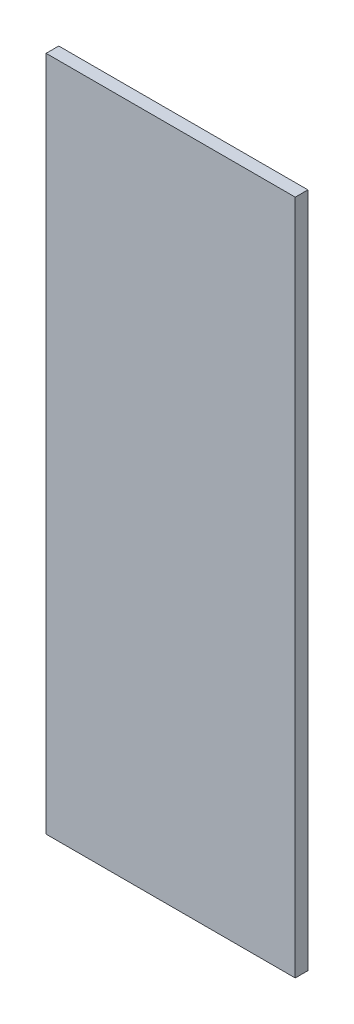
ISO-10303-21;
HEADER;
FILE_DESCRIPTION(('STEP AP214'),'2;1');
FILE_NAME('part.step','',(''),(''),'','','');
FILE_SCHEMA(('AUTOMOTIVE_DESIGN { 1 0 10303 214 1 1 1 1 }'));
ENDSEC;
DATA;
#1=APPLICATION_CONTEXT('core data for automotive mechanical design processes');
#2=APPLICATION_PROTOCOL_DEFINITION('international standard','automotive_design',2000,#1);
#3=PRODUCT_CONTEXT('',#1,'mechanical');
#4=PRODUCT('Part','Part','',(#3));
#5=PRODUCT_RELATED_PRODUCT_CATEGORY('part','',(#4));
#6=PRODUCT_DEFINITION_FORMATION('','',#4);
#7=PRODUCT_DEFINITION_CONTEXT('part definition',#1,'design');
#8=PRODUCT_DEFINITION('design','',#6,#7);
#9=PRODUCT_DEFINITION_SHAPE('','',#8);
#10=(LENGTH_UNIT() NAMED_UNIT(*) SI_UNIT(.MILLI.,.METRE.));
#11=(NAMED_UNIT(*) PLANE_ANGLE_UNIT() SI_UNIT($,.RADIAN.));
#12=(NAMED_UNIT(*) SI_UNIT($,.STERADIAN.) SOLID_ANGLE_UNIT());
#13=UNCERTAINTY_MEASURE_WITH_UNIT(LENGTH_MEASURE(1.E-05),#10,'distance_accuracy_value','');
#14=(GEOMETRIC_REPRESENTATION_CONTEXT(3) GLOBAL_UNCERTAINTY_ASSIGNED_CONTEXT((#13)) GLOBAL_UNIT_ASSIGNED_CONTEXT((#10,
#11,#12)) REPRESENTATION_CONTEXT('',''));
#15=CARTESIAN_POINT('',(0.,0.,0.));
#16=DIRECTION('',(0.,0.,1.));
#17=DIRECTION('',(1.,0.,0.));
#18=AXIS2_PLACEMENT_3D('',#15,#16,#17);
#19=CARTESIAN_POINT('',(89.1920013427734,76.5279998779297,0.));
#20=DIRECTION('',(1.,0.,0.));
#21=DIRECTION('',(0.,-1.,0.));
#22=AXIS2_PLACEMENT_3D('',#19,#20,#21);
#23=PLANE('',#22);
#24=DIRECTION('',(0.,-1.,0.));
#25=VECTOR('',#24,1.);
#26=CARTESIAN_POINT('',(89.1920013427734,76.5279998779297,0.03556));
#27=LINE('',#26,#25);
#28=CARTESIAN_POINT('',(89.1920013427734,76.5279998779297,0.03556));
#29=VERTEX_POINT('',#28);
#30=CARTESIAN_POINT('',(89.1920013427734,74.6279983520508,0.03556));
#31=VERTEX_POINT('',#30);
#32=EDGE_CURVE('E11',#29,#31,#27,.T.);
#33=ORIENTED_EDGE('',*,*,#32,.F.);
#34=DIRECTION('',(0.,0.,1.));
#35=VECTOR('',#34,1.);
#36=CARTESIAN_POINT('',(89.1920013427734,76.5279998779297,0.));
#37=LINE('',#36,#35);
#38=CARTESIAN_POINT('',(89.1920013427734,76.5279998779297,0.));
#39=VERTEX_POINT('',#38);
#40=EDGE_CURVE('E24',#39,#29,#37,.T.);
#41=ORIENTED_EDGE('',*,*,#40,.F.);
#42=DIRECTION('',(0.,-1.,0.));
#43=VECTOR('',#42,1.);
#44=CARTESIAN_POINT('',(89.1920013427734,76.5279998779297,0.));
#45=LINE('',#44,#43);
#46=CARTESIAN_POINT('',(89.1920013427734,74.6279983520508,0.));
#47=VERTEX_POINT('',#46);
#48=EDGE_CURVE('E75',#39,#47,#45,.T.);
#49=ORIENTED_EDGE('',*,*,#48,.T.);
#50=DIRECTION('',(0.,0.,1.));
#51=VECTOR('',#50,1.);
#52=CARTESIAN_POINT('',(89.1920013427734,74.6279983520508,0.));
#53=LINE('',#52,#51);
#54=EDGE_CURVE('E37',#47,#31,#53,.T.);
#55=ORIENTED_EDGE('',*,*,#54,.T.);
#56=EDGE_LOOP('',(#33,#41,#49,#55));
#57=FACE_BOUND('',#56,.T.);
#58=ADVANCED_FACE('F17',(#57),#23,.F.);
#59=CARTESIAN_POINT('',(89.1920013427734,74.6279983520508,0.));
#60=DIRECTION('',(0.,1.,0.));
#61=DIRECTION('',(1.,0.,0.));
#62=AXIS2_PLACEMENT_3D('',#59,#60,#61);
#63=PLANE('',#62);
#64=DIRECTION('',(1.,0.,0.));
#65=VECTOR('',#64,1.);
#66=CARTESIAN_POINT('',(89.1920013427734,74.6279983520508,0.03556));
#67=LINE('',#66,#65);
#68=CARTESIAN_POINT('',(89.8919982910156,74.6279983520508,0.03556));
#69=VERTEX_POINT('',#68);
#70=EDGE_CURVE('E83',#31,#69,#67,.T.);
#71=ORIENTED_EDGE('',*,*,#70,.F.);
#72=ORIENTED_EDGE('',*,*,#54,.F.);
#73=DIRECTION('',(1.,0.,0.));
#74=VECTOR('',#73,1.);
#75=CARTESIAN_POINT('',(89.1920013427734,74.6279983520508,0.));
#76=LINE('',#75,#74);
#77=CARTESIAN_POINT('',(89.8919982910156,74.6279983520508,0.));
#78=VERTEX_POINT('',#77);
#79=EDGE_CURVE('E81',#47,#78,#76,.T.);
#80=ORIENTED_EDGE('',*,*,#79,.T.);
#81=DIRECTION('',(0.,0.,1.));
#82=VECTOR('',#81,1.);
#83=CARTESIAN_POINT('',(89.8919982910156,74.6279983520508,0.));
#84=LINE('',#83,#82);
#85=EDGE_CURVE('E67',#78,#69,#84,.T.);
#86=ORIENTED_EDGE('',*,*,#85,.T.);
#87=EDGE_LOOP('',(#71,#72,#80,#86));
#88=FACE_BOUND('',#87,.T.);
#89=ADVANCED_FACE('F89',(#88),#63,.F.);
#90=CARTESIAN_POINT('',(89.8919982910156,74.6279983520508,0.));
#91=DIRECTION('',(-1.,0.,0.));
#92=DIRECTION('',(0.,1.,0.));
#93=AXIS2_PLACEMENT_3D('',#90,#91,#92);
#94=PLANE('',#93);
#95=DIRECTION('',(0.,1.,0.));
#96=VECTOR('',#95,1.);
#97=CARTESIAN_POINT('',(89.8919982910156,74.6279983520508,0.03556));
#98=LINE('',#97,#96);
#99=CARTESIAN_POINT('',(89.8919982910156,76.5279998779297,0.03556));
#100=VERTEX_POINT('',#99);
#101=EDGE_CURVE('E71',#69,#100,#98,.T.);
#102=ORIENTED_EDGE('',*,*,#101,.F.);
#103=ORIENTED_EDGE('',*,*,#85,.F.);
#104=DIRECTION('',(0.,1.,0.));
#105=VECTOR('',#104,1.);
#106=CARTESIAN_POINT('',(89.8919982910156,74.6279983520508,0.));
#107=LINE('',#106,#105);
#108=CARTESIAN_POINT('',(89.8919982910156,76.5279998779297,0.));
#109=VERTEX_POINT('',#108);
#110=EDGE_CURVE('E63',#78,#109,#107,.T.);
#111=ORIENTED_EDGE('',*,*,#110,.T.);
#112=DIRECTION('',(0.,0.,1.));
#113=VECTOR('',#112,1.);
#114=CARTESIAN_POINT('',(89.8919982910156,76.5279998779297,0.));
#115=LINE('',#114,#113);
#116=EDGE_CURVE('E53',#109,#100,#115,.T.);
#117=ORIENTED_EDGE('',*,*,#116,.T.);
#118=EDGE_LOOP('',(#102,#103,#111,#117));
#119=FACE_BOUND('',#118,.T.);
#120=ADVANCED_FACE('F66',(#119),#94,.F.);
#121=CARTESIAN_POINT('',(89.8919982910156,76.5279998779297,0.));
#122=DIRECTION('',(0.,-1.,0.));
#123=DIRECTION('',(-1.,0.,0.));
#124=AXIS2_PLACEMENT_3D('',#121,#122,#123);
#125=PLANE('',#124);
#126=DIRECTION('',(-1.,0.,0.));
#127=VECTOR('',#126,1.);
#128=CARTESIAN_POINT('',(89.8919982910156,76.5279998779297,0.03556));
#129=LINE('',#128,#127);
#130=EDGE_CURVE('E59',#100,#29,#129,.T.);
#131=ORIENTED_EDGE('',*,*,#130,.F.);
#132=ORIENTED_EDGE('',*,*,#116,.F.);
#133=DIRECTION('',(-1.,0.,0.));
#134=VECTOR('',#133,1.);
#135=CARTESIAN_POINT('',(89.8919982910156,76.5279998779297,0.));
#136=LINE('',#135,#134);
#137=EDGE_CURVE('E57',#109,#39,#136,.T.);
#138=ORIENTED_EDGE('',*,*,#137,.T.);
#139=ORIENTED_EDGE('',*,*,#40,.T.);
#140=EDGE_LOOP('',(#131,#132,#138,#139));
#141=FACE_BOUND('',#140,.T.);
#142=ADVANCED_FACE('F55',(#141),#125,.F.);
#143=CARTESIAN_POINT('',(89.1920013427734,76.5279998779297,0.));
#144=DIRECTION('',(0.,0.,-1.));
#145=DIRECTION('',(-1.,0.,0.));
#146=AXIS2_PLACEMENT_3D('',#143,#144,#145);
#147=PLANE('',#146);
#148=ORIENTED_EDGE('',*,*,#137,.F.);
#149=ORIENTED_EDGE('',*,*,#110,.F.);
#150=ORIENTED_EDGE('',*,*,#79,.F.);
#151=ORIENTED_EDGE('',*,*,#48,.F.);
#152=EDGE_LOOP('',(#148,#149,#150,#151));
#153=FACE_BOUND('',#152,.T.);
#154=ADVANCED_FACE('F74',(#153),#147,.T.);
#155=CARTESIAN_POINT('',(89.1920013427734,76.5279998779297,0.03556));
#156=DIRECTION('',(0.,0.,-1.));
#157=DIRECTION('',(-1.,0.,0.));
#158=AXIS2_PLACEMENT_3D('',#155,#156,#157);
#159=PLANE('',#158);
#160=ORIENTED_EDGE('',*,*,#32,.T.);
#161=ORIENTED_EDGE('',*,*,#70,.T.);
#162=ORIENTED_EDGE('',*,*,#101,.T.);
#163=ORIENTED_EDGE('',*,*,#130,.T.);
#164=EDGE_LOOP('',(#160,#161,#162,#163));
#165=FACE_BOUND('',#164,.T.);
#166=ADVANCED_FACE('F91',(#165),#159,.F.);
#167=CLOSED_SHELL('',(#58,#89,#120,#142,#154,#166));
#168=MANIFOLD_SOLID_BREP('B1',#167);
#169=ADVANCED_BREP_SHAPE_REPRESENTATION('',(#18,#168),#14);
#170=SHAPE_DEFINITION_REPRESENTATION(#9,#169);
ENDSEC;
END-ISO-10303-21;
